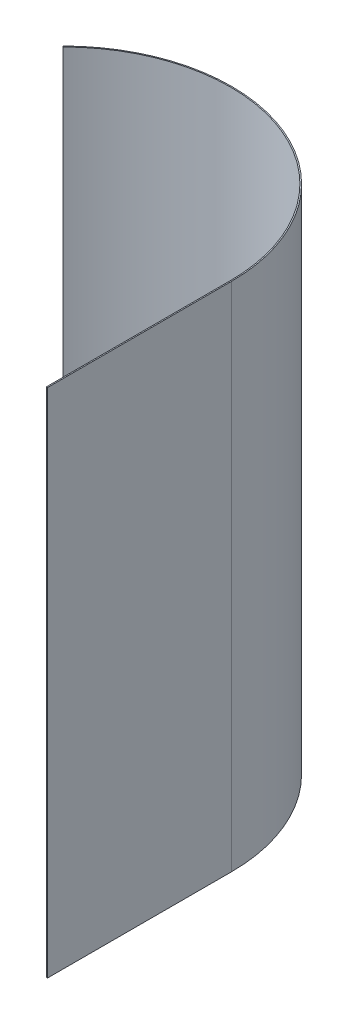
ISO-10303-21;
HEADER;
FILE_DESCRIPTION(('STEP AP214'),'2;1');
FILE_NAME('part.step','',(''),(''),'','','');
FILE_SCHEMA(('AUTOMOTIVE_DESIGN { 1 0 10303 214 1 1 1 1 }'));
ENDSEC;
DATA;
#1=APPLICATION_CONTEXT('core data for automotive mechanical design processes');
#2=APPLICATION_PROTOCOL_DEFINITION('international standard','automotive_design',2000,#1);
#3=PRODUCT_CONTEXT('',#1,'mechanical');
#4=PRODUCT('Part','Part','',(#3));
#5=PRODUCT_RELATED_PRODUCT_CATEGORY('part','',(#4));
#6=PRODUCT_DEFINITION_FORMATION('','',#4);
#7=PRODUCT_DEFINITION_CONTEXT('part definition',#1,'design');
#8=PRODUCT_DEFINITION('design','',#6,#7);
#9=PRODUCT_DEFINITION_SHAPE('','',#8);
#10=(LENGTH_UNIT() NAMED_UNIT(*) SI_UNIT(.MILLI.,.METRE.));
#11=(NAMED_UNIT(*) PLANE_ANGLE_UNIT() SI_UNIT($,.RADIAN.));
#12=(NAMED_UNIT(*) SI_UNIT($,.STERADIAN.) SOLID_ANGLE_UNIT());
#13=UNCERTAINTY_MEASURE_WITH_UNIT(LENGTH_MEASURE(1.E-05),#10,'distance_accuracy_value','');
#14=(GEOMETRIC_REPRESENTATION_CONTEXT(3) GLOBAL_UNCERTAINTY_ASSIGNED_CONTEXT((#13)) GLOBAL_UNIT_ASSIGNED_CONTEXT((#10,
#11,#12)) REPRESENTATION_CONTEXT('',''));
#15=CARTESIAN_POINT('',(0.,0.,0.));
#16=DIRECTION('',(0.,0.,1.));
#17=DIRECTION('',(1.,0.,0.));
#18=AXIS2_PLACEMENT_3D('',#15,#16,#17);
#19=CARTESIAN_POINT('',(-133.85,500.,-127.741818937993));
#20=DIRECTION('',(0.,-1.,0.));
#21=DIRECTION('',(0.,0.,-1.));
#22=AXIS2_PLACEMENT_3D('',#19,#20,#21);
#23=CYLINDRICAL_SURFACE('',#22,165.);
#24=CARTESIAN_POINT('',(-133.85,0.,-127.741818937993));
#25=DIRECTION('',(0.,1.,0.));
#26=DIRECTION('',(0.,0.,-1.));
#27=AXIS2_PLACEMENT_3D('',#24,#25,#26);
#28=CIRCLE('',#27,165.);
#29=CARTESIAN_POINT('',(31.15,0.,-127.741818937994));
#30=VERTEX_POINT('',#29);
#31=CARTESIAN_POINT('',(-250.52261889578,0.,-244.414437833774));
#32=VERTEX_POINT('',#31);
#33=EDGE_CURVE('E134',#30,#32,#28,.T.);
#34=ORIENTED_EDGE('',*,*,#33,.T.);
#35=DIRECTION('',(0.,-1.,0.));
#36=VECTOR('',#35,1.);
#37=CARTESIAN_POINT('',(-250.52261889578,500.,-244.414437833774));
#38=LINE('',#37,#36);
#39=CARTESIAN_POINT('',(-250.52261889578,500.,-244.414437833774));
#40=VERTEX_POINT('',#39);
#41=EDGE_CURVE('E11',#40,#32,#38,.T.);
#42=ORIENTED_EDGE('',*,*,#41,.F.);
#43=CARTESIAN_POINT('',(-133.85,500.,-127.741818937993));
#44=DIRECTION('',(0.,1.,0.));
#45=DIRECTION('',(0.,0.,-1.));
#46=AXIS2_PLACEMENT_3D('',#43,#44,#45);
#47=CIRCLE('',#46,165.);
#48=CARTESIAN_POINT('',(31.15,500.,-127.741818937994));
#49=VERTEX_POINT('',#48);
#50=EDGE_CURVE('E150',#49,#40,#47,.T.);
#51=ORIENTED_EDGE('',*,*,#50,.F.);
#52=DIRECTION('',(0.,-1.,0.));
#53=VECTOR('',#52,1.);
#54=CARTESIAN_POINT('',(31.15,500.,-127.741818937994));
#55=LINE('',#54,#53);
#56=EDGE_CURVE('E130',#49,#30,#55,.T.);
#57=ORIENTED_EDGE('',*,*,#56,.T.);
#58=EDGE_LOOP('',(#34,#42,#51,#57));
#59=FACE_BOUND('',#58,.T.);
#60=ADVANCED_FACE('F45',(#59),#23,.T.);
#61=CARTESIAN_POINT('',(-249.709446097416,500.,-243.601265035409));
#62=DIRECTION('',(0.707106781186535,0.,-0.70710678118656));
#63=DIRECTION('',(-0.70710678118656,0.,-0.707106781186535));
#64=AXIS2_PLACEMENT_3D('',#61,#62,#63);
#65=PLANE('',#64);
#66=DIRECTION('',(0.70710678118656,0.,0.707106781186535));
#67=VECTOR('',#66,1.);
#68=CARTESIAN_POINT('',(-249.709446097416,0.,-243.601265035409));
#69=LINE('',#68,#67);
#70=CARTESIAN_POINT('',(-249.709446097416,0.,-243.601265035409));
#71=VERTEX_POINT('',#70);
#72=EDGE_CURVE('E138',#32,#71,#69,.T.);
#73=ORIENTED_EDGE('',*,*,#72,.T.);
#74=DIRECTION('',(0.,-1.,0.));
#75=VECTOR('',#74,1.);
#76=CARTESIAN_POINT('',(-249.709446097416,500.,-243.601265035409));
#77=LINE('',#76,#75);
#78=CARTESIAN_POINT('',(-249.709446097416,500.,-243.601265035409));
#79=VERTEX_POINT('',#78);
#80=EDGE_CURVE('E54',#79,#71,#77,.T.);
#81=ORIENTED_EDGE('',*,*,#80,.F.);
#82=DIRECTION('',(0.70710678118656,0.,0.707106781186535));
#83=VECTOR('',#82,1.);
#84=CARTESIAN_POINT('',(-249.709446097416,500.,-243.601265035409));
#85=LINE('',#84,#83);
#86=EDGE_CURVE('E99',#40,#79,#85,.T.);
#87=ORIENTED_EDGE('',*,*,#86,.F.);
#88=ORIENTED_EDGE('',*,*,#41,.T.);
#89=EDGE_LOOP('',(#73,#81,#87,#88));
#90=FACE_BOUND('',#89,.T.);
#91=ADVANCED_FACE('F178',(#90),#65,.F.);
#92=CARTESIAN_POINT('',(-133.85,500.,-127.741818937993));
#93=DIRECTION('',(0.,-1.,0.));
#94=DIRECTION('',(0.,0.,-1.));
#95=AXIS2_PLACEMENT_3D('',#92,#93,#94);
#96=CYLINDRICAL_SURFACE('',#95,163.85);
#97=CARTESIAN_POINT('',(-133.85,0.,-127.741818937993));
#98=DIRECTION('',(0.,-1.,0.));
#99=DIRECTION('',(0.,0.,1.));
#100=AXIS2_PLACEMENT_3D('',#97,#98,#99);
#101=CIRCLE('',#100,163.85);
#102=CARTESIAN_POINT('',(30.,0.,-127.741818937994));
#103=VERTEX_POINT('',#102);
#104=EDGE_CURVE('E141',#71,#103,#101,.T.);
#105=ORIENTED_EDGE('',*,*,#104,.T.);
#106=DIRECTION('',(0.,-1.,0.));
#107=VECTOR('',#106,1.);
#108=CARTESIAN_POINT('',(30.,500.,-127.741818937994));
#109=LINE('',#108,#107);
#110=CARTESIAN_POINT('',(30.,500.,-127.741818937994));
#111=VERTEX_POINT('',#110);
#112=EDGE_CURVE('E123',#111,#103,#109,.T.);
#113=ORIENTED_EDGE('',*,*,#112,.F.);
#114=CARTESIAN_POINT('',(-133.85,500.,-127.741818937993));
#115=DIRECTION('',(0.,-1.,0.));
#116=DIRECTION('',(0.,0.,1.));
#117=AXIS2_PLACEMENT_3D('',#114,#115,#116);
#118=CIRCLE('',#117,163.85);
#119=EDGE_CURVE('E112',#79,#111,#118,.T.);
#120=ORIENTED_EDGE('',*,*,#119,.F.);
#121=ORIENTED_EDGE('',*,*,#80,.T.);
#122=EDGE_LOOP('',(#105,#113,#120,#121));
#123=FACE_BOUND('',#122,.T.);
#124=ADVANCED_FACE('F160',(#123),#96,.F.);
#125=CARTESIAN_POINT('',(30.,500.,52.2581810620061));
#126=DIRECTION('',(1.,0.,0.));
#127=DIRECTION('',(0.,0.,-1.));
#128=AXIS2_PLACEMENT_3D('',#125,#126,#127);
#129=PLANE('',#128);
#130=DIRECTION('',(0.,0.,1.));
#131=VECTOR('',#130,1.);
#132=CARTESIAN_POINT('',(30.,0.,52.2581810620061));
#133=LINE('',#132,#131);
#134=CARTESIAN_POINT('',(30.,0.,52.2581810620061));
#135=VERTEX_POINT('',#134);
#136=EDGE_CURVE('E121',#103,#135,#133,.T.);
#137=ORIENTED_EDGE('',*,*,#136,.T.);
#138=DIRECTION('',(0.,-1.,0.));
#139=VECTOR('',#138,1.);
#140=CARTESIAN_POINT('',(30.,500.,52.2581810620061));
#141=LINE('',#140,#139);
#142=CARTESIAN_POINT('',(30.,500.,52.2581810620061));
#143=VERTEX_POINT('',#142);
#144=EDGE_CURVE('E118',#143,#135,#141,.T.);
#145=ORIENTED_EDGE('',*,*,#144,.F.);
#146=DIRECTION('',(0.,0.,1.));
#147=VECTOR('',#146,1.);
#148=CARTESIAN_POINT('',(30.,500.,52.2581810620061));
#149=LINE('',#148,#147);
#150=EDGE_CURVE('E106',#111,#143,#149,.T.);
#151=ORIENTED_EDGE('',*,*,#150,.F.);
#152=ORIENTED_EDGE('',*,*,#112,.T.);
#153=EDGE_LOOP('',(#137,#145,#151,#152));
#154=FACE_BOUND('',#153,.T.);
#155=ADVANCED_FACE('F119',(#154),#129,.F.);
#156=CARTESIAN_POINT('',(31.15,500.,52.2581810620061));
#157=DIRECTION('',(0.,0.,-1.));
#158=DIRECTION('',(-1.,0.,0.));
#159=AXIS2_PLACEMENT_3D('',#156,#157,#158);
#160=PLANE('',#159);
#161=DIRECTION('',(1.,0.,0.));
#162=VECTOR('',#161,1.);
#163=CARTESIAN_POINT('',(31.15,0.,52.2581810620061));
#164=LINE('',#163,#162);
#165=CARTESIAN_POINT('',(31.15,0.,52.2581810620061));
#166=VERTEX_POINT('',#165);
#167=EDGE_CURVE('E85',#135,#166,#164,.T.);
#168=ORIENTED_EDGE('',*,*,#167,.T.);
#169=DIRECTION('',(0.,-1.,0.));
#170=VECTOR('',#169,1.);
#171=CARTESIAN_POINT('',(31.15,500.,52.2581810620061));
#172=LINE('',#171,#170);
#173=CARTESIAN_POINT('',(31.15,500.,52.2581810620061));
#174=VERTEX_POINT('',#173);
#175=EDGE_CURVE('E124',#174,#166,#172,.T.);
#176=ORIENTED_EDGE('',*,*,#175,.F.);
#177=DIRECTION('',(1.,0.,0.));
#178=VECTOR('',#177,1.);
#179=CARTESIAN_POINT('',(31.15,500.,52.2581810620061));
#180=LINE('',#179,#178);
#181=EDGE_CURVE('E110',#143,#174,#180,.T.);
#182=ORIENTED_EDGE('',*,*,#181,.F.);
#183=ORIENTED_EDGE('',*,*,#144,.T.);
#184=EDGE_LOOP('',(#168,#176,#182,#183));
#185=FACE_BOUND('',#184,.T.);
#186=ADVANCED_FACE('F126',(#185),#160,.F.);
#187=CARTESIAN_POINT('',(31.15,500.,-127.741818937994));
#188=DIRECTION('',(-1.,0.,0.));
#189=DIRECTION('',(0.,0.,1.));
#190=AXIS2_PLACEMENT_3D('',#187,#188,#189);
#191=PLANE('',#190);
#192=DIRECTION('',(0.,0.,-1.));
#193=VECTOR('',#192,1.);
#194=CARTESIAN_POINT('',(31.15,0.,-127.741818937994));
#195=LINE('',#194,#193);
#196=EDGE_CURVE('E91',#166,#30,#195,.T.);
#197=ORIENTED_EDGE('',*,*,#196,.T.);
#198=ORIENTED_EDGE('',*,*,#56,.F.);
#199=DIRECTION('',(0.,0.,-1.));
#200=VECTOR('',#199,1.);
#201=CARTESIAN_POINT('',(31.15,500.,-127.741818937994));
#202=LINE('',#201,#200);
#203=EDGE_CURVE('E62',#174,#49,#202,.T.);
#204=ORIENTED_EDGE('',*,*,#203,.F.);
#205=ORIENTED_EDGE('',*,*,#175,.T.);
#206=EDGE_LOOP('',(#197,#198,#204,#205));
#207=FACE_BOUND('',#206,.T.);
#208=ADVANCED_FACE('F167',(#207),#191,.F.);
#209=CARTESIAN_POINT('',(-133.85,500.,-127.741818937993));
#210=DIRECTION('',(0.,-1.,0.));
#211=DIRECTION('',(0.,0.,-1.));
#212=AXIS2_PLACEMENT_3D('',#209,#210,#211);
#213=PLANE('',#212);
#214=ORIENTED_EDGE('',*,*,#50,.T.);
#215=ORIENTED_EDGE('',*,*,#86,.T.);
#216=ORIENTED_EDGE('',*,*,#119,.T.);
#217=ORIENTED_EDGE('',*,*,#150,.T.);
#218=ORIENTED_EDGE('',*,*,#181,.T.);
#219=ORIENTED_EDGE('',*,*,#203,.T.);
#220=EDGE_LOOP('',(#214,#215,#216,#217,#218,#219));
#221=FACE_BOUND('',#220,.T.);
#222=ADVANCED_FACE('F108',(#221),#213,.F.);
#223=CARTESIAN_POINT('',(-133.85,0.,-127.741818937993));
#224=DIRECTION('',(0.,-1.,0.));
#225=DIRECTION('',(0.,0.,-1.));
#226=AXIS2_PLACEMENT_3D('',#223,#224,#225);
#227=PLANE('',#226);
#228=ORIENTED_EDGE('',*,*,#33,.F.);
#229=ORIENTED_EDGE('',*,*,#196,.F.);
#230=ORIENTED_EDGE('',*,*,#167,.F.);
#231=ORIENTED_EDGE('',*,*,#136,.F.);
#232=ORIENTED_EDGE('',*,*,#104,.F.);
#233=ORIENTED_EDGE('',*,*,#72,.F.);
#234=EDGE_LOOP('',(#228,#229,#230,#231,#232,#233));
#235=FACE_BOUND('',#234,.T.);
#236=ADVANCED_FACE('F163',(#235),#227,.T.);
#237=CLOSED_SHELL('',(#60,#91,#124,#155,#186,#208,#222,#236));
#238=MANIFOLD_SOLID_BREP('B2',#237);
#239=ADVANCED_BREP_SHAPE_REPRESENTATION('',(#18,#238),#14);
#240=SHAPE_DEFINITION_REPRESENTATION(#9,#239);
ENDSEC;
END-ISO-10303-21;
